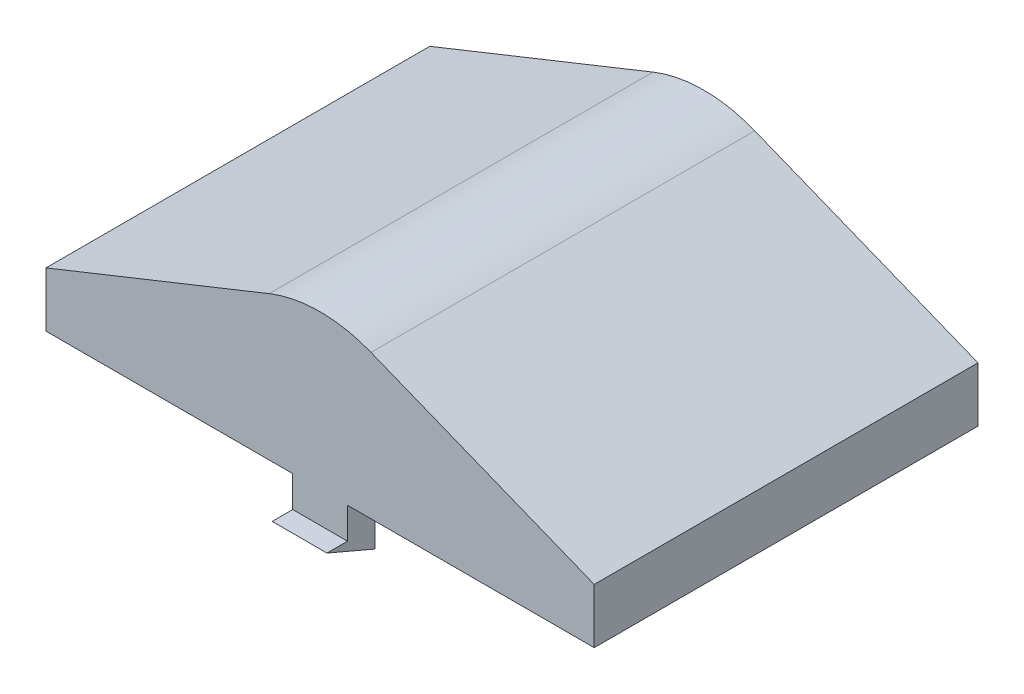
ISO-10303-21;
HEADER;
FILE_DESCRIPTION(('STEP AP214'),'2;1');
FILE_NAME('part.step','',(''),(''),'','','');
FILE_SCHEMA(('AUTOMOTIVE_DESIGN { 1 0 10303 214 1 1 1 1 }'));
ENDSEC;
DATA;
#1=APPLICATION_CONTEXT('core data for automotive mechanical design processes');
#2=APPLICATION_PROTOCOL_DEFINITION('international standard','automotive_design',2000,#1);
#3=PRODUCT_CONTEXT('',#1,'mechanical');
#4=PRODUCT('Part','Part','',(#3));
#5=PRODUCT_RELATED_PRODUCT_CATEGORY('part','',(#4));
#6=PRODUCT_DEFINITION_FORMATION('','',#4);
#7=PRODUCT_DEFINITION_CONTEXT('part definition',#1,'design');
#8=PRODUCT_DEFINITION('design','',#6,#7);
#9=PRODUCT_DEFINITION_SHAPE('','',#8);
#10=(LENGTH_UNIT() NAMED_UNIT(*) SI_UNIT(.MILLI.,.METRE.));
#11=(NAMED_UNIT(*) PLANE_ANGLE_UNIT() SI_UNIT($,.RADIAN.));
#12=(NAMED_UNIT(*) SI_UNIT($,.STERADIAN.) SOLID_ANGLE_UNIT());
#13=UNCERTAINTY_MEASURE_WITH_UNIT(LENGTH_MEASURE(1.E-05),#10,'distance_accuracy_value','');
#14=(GEOMETRIC_REPRESENTATION_CONTEXT(3) GLOBAL_UNCERTAINTY_ASSIGNED_CONTEXT((#13)) GLOBAL_UNIT_ASSIGNED_CONTEXT((#10,
#11,#12)) REPRESENTATION_CONTEXT('',''));
#15=CARTESIAN_POINT('',(0.,0.,0.));
#16=DIRECTION('',(0.,0.,1.));
#17=DIRECTION('',(1.,0.,0.));
#18=AXIS2_PLACEMENT_3D('',#15,#16,#17);
#19=CARTESIAN_POINT('',(-10.,0.,7.));
#20=DIRECTION('',(0.,1.,0.));
#21=DIRECTION('',(-1.,0.,0.));
#22=AXIS2_PLACEMENT_3D('',#19,#20,#21);
#23=PLANE('',#22);
#24=DIRECTION('',(0.,0.,-1.));
#25=VECTOR('',#24,1.);
#26=CARTESIAN_POINT('',(-1.,0.,-6.));
#27=LINE('',#26,#25);
#28=CARTESIAN_POINT('',(-1.,0.,-6.));
#29=VERTEX_POINT('',#28);
#30=CARTESIAN_POINT('',(-1.,0.,-7.));
#31=VERTEX_POINT('',#30);
#32=EDGE_CURVE('E202',#29,#31,#27,.T.);
#33=ORIENTED_EDGE('',*,*,#32,.F.);
#34=DIRECTION('',(1.,0.,0.));
#35=VECTOR('',#34,1.);
#36=CARTESIAN_POINT('',(10.,0.,-6.));
#37=LINE('',#36,#35);
#38=CARTESIAN_POINT('',(-9.,0.,-6.));
#39=VERTEX_POINT('',#38);
#40=EDGE_CURVE('E280',#39,#29,#37,.T.);
#41=ORIENTED_EDGE('',*,*,#40,.F.);
#42=DIRECTION('',(0.,0.,-1.));
#43=VECTOR('',#42,1.);
#44=CARTESIAN_POINT('',(-9.,0.,7.));
#45=LINE('',#44,#43);
#46=CARTESIAN_POINT('',(-9.,0.,6.));
#47=VERTEX_POINT('',#46);
#48=EDGE_CURVE('E303',#47,#39,#45,.T.);
#49=ORIENTED_EDGE('',*,*,#48,.F.);
#50=DIRECTION('',(1.,0.,0.));
#51=VECTOR('',#50,1.);
#52=CARTESIAN_POINT('',(10.,0.,6.));
#53=LINE('',#52,#51);
#54=CARTESIAN_POINT('',(-1.,0.,6.));
#55=VERTEX_POINT('',#54);
#56=EDGE_CURVE('E309',#47,#55,#53,.T.);
#57=ORIENTED_EDGE('',*,*,#56,.T.);
#58=DIRECTION('',(0.,0.,1.));
#59=VECTOR('',#58,1.);
#60=CARTESIAN_POINT('',(-1.,0.,6.));
#61=LINE('',#60,#59);
#62=CARTESIAN_POINT('',(-1.,0.,7.));
#63=VERTEX_POINT('',#62);
#64=EDGE_CURVE('E247',#55,#63,#61,.T.);
#65=ORIENTED_EDGE('',*,*,#64,.T.);
#66=DIRECTION('',(1.,0.,0.));
#67=VECTOR('',#66,1.);
#68=CARTESIAN_POINT('',(-10.,0.,7.));
#69=LINE('',#68,#67);
#70=CARTESIAN_POINT('',(-10.,0.,7.));
#71=VERTEX_POINT('',#70);
#72=EDGE_CURVE('E318',#71,#63,#69,.T.);
#73=ORIENTED_EDGE('',*,*,#72,.F.);
#74=DIRECTION('',(0.,0.,-1.));
#75=VECTOR('',#74,1.);
#76=CARTESIAN_POINT('',(-10.,0.,7.));
#77=LINE('',#76,#75);
#78=CARTESIAN_POINT('',(-10.,0.,-7.));
#79=VERTEX_POINT('',#78);
#80=EDGE_CURVE('E342',#71,#79,#77,.T.);
#81=ORIENTED_EDGE('',*,*,#80,.T.);
#82=DIRECTION('',(1.,0.,0.));
#83=VECTOR('',#82,1.);
#84=CARTESIAN_POINT('',(-10.,0.,-7.));
#85=LINE('',#84,#83);
#86=EDGE_CURVE('E335',#79,#31,#85,.T.);
#87=ORIENTED_EDGE('',*,*,#86,.T.);
#88=EDGE_LOOP('',(#33,#41,#49,#57,#65,#73,#81,#87));
#89=FACE_BOUND('',#88,.T.);
#90=ADVANCED_FACE('F34',(#89),#23,.F.);
#91=CARTESIAN_POINT('',(1.,0.,-6.));
#92=VERTEX_POINT('',#91);
#93=CARTESIAN_POINT('',(9.,0.,-6.));
#94=VERTEX_POINT('',#93);
#95=EDGE_CURVE('E305',#92,#94,#37,.T.);
#96=ORIENTED_EDGE('',*,*,#95,.F.);
#97=DIRECTION('',(0.,0.,-1.));
#98=VECTOR('',#97,1.);
#99=CARTESIAN_POINT('',(1.,0.,-6.));
#100=LINE('',#99,#98);
#101=CARTESIAN_POINT('',(1.,0.,-7.));
#102=VERTEX_POINT('',#101);
#103=EDGE_CURVE('E51',#92,#102,#100,.T.);
#104=ORIENTED_EDGE('',*,*,#103,.T.);
#105=CARTESIAN_POINT('',(10.,0.,-7.));
#106=VERTEX_POINT('',#105);
#107=EDGE_CURVE('E334',#102,#106,#85,.T.);
#108=ORIENTED_EDGE('',*,*,#107,.T.);
#109=DIRECTION('',(0.,0.,-1.));
#110=VECTOR('',#109,1.);
#111=CARTESIAN_POINT('',(10.,0.,7.));
#112=LINE('',#111,#110);
#113=CARTESIAN_POINT('',(10.,0.,7.));
#114=VERTEX_POINT('',#113);
#115=EDGE_CURVE('E339',#114,#106,#112,.T.);
#116=ORIENTED_EDGE('',*,*,#115,.F.);
#117=CARTESIAN_POINT('',(1.,0.,7.));
#118=VERTEX_POINT('',#117);
#119=EDGE_CURVE('E315',#118,#114,#69,.T.);
#120=ORIENTED_EDGE('',*,*,#119,.F.);
#121=DIRECTION('',(0.,0.,1.));
#122=VECTOR('',#121,1.);
#123=CARTESIAN_POINT('',(1.,0.,6.));
#124=LINE('',#123,#122);
#125=CARTESIAN_POINT('',(1.,0.,6.));
#126=VERTEX_POINT('',#125);
#127=EDGE_CURVE('E59',#126,#118,#124,.T.);
#128=ORIENTED_EDGE('',*,*,#127,.F.);
#129=CARTESIAN_POINT('',(9.,0.,6.));
#130=VERTEX_POINT('',#129);
#131=EDGE_CURVE('E236',#126,#130,#53,.T.);
#132=ORIENTED_EDGE('',*,*,#131,.T.);
#133=DIRECTION('',(0.,0.,-1.));
#134=VECTOR('',#133,1.);
#135=CARTESIAN_POINT('',(9.,0.,7.));
#136=LINE('',#135,#134);
#137=EDGE_CURVE('E307',#130,#94,#136,.T.);
#138=ORIENTED_EDGE('',*,*,#137,.T.);
#139=EDGE_LOOP('',(#96,#104,#108,#116,#120,#128,#132,#138));
#140=FACE_BOUND('',#139,.T.);
#141=ADVANCED_FACE('F411',(#140),#23,.F.);
#142=CARTESIAN_POINT('',(10.,0.,7.));
#143=DIRECTION('',(-1.,0.,0.));
#144=DIRECTION('',(0.,-1.,0.));
#145=AXIS2_PLACEMENT_3D('',#142,#143,#144);
#146=PLANE('',#145);
#147=DIRECTION('',(0.,1.,0.));
#148=VECTOR('',#147,1.);
#149=CARTESIAN_POINT('',(10.,0.,-7.));
#150=LINE('',#149,#148);
#151=CARTESIAN_POINT('',(10.,2.,-7.));
#152=VERTEX_POINT('',#151);
#153=EDGE_CURVE('E292',#106,#152,#150,.T.);
#154=ORIENTED_EDGE('',*,*,#153,.T.);
#155=DIRECTION('',(0.,0.,-1.));
#156=VECTOR('',#155,1.);
#157=CARTESIAN_POINT('',(10.,2.,7.));
#158=LINE('',#157,#156);
#159=CARTESIAN_POINT('',(10.,2.,7.));
#160=VERTEX_POINT('',#159);
#161=EDGE_CURVE('E348',#160,#152,#158,.T.);
#162=ORIENTED_EDGE('',*,*,#161,.F.);
#163=DIRECTION('',(0.,1.,0.));
#164=VECTOR('',#163,1.);
#165=CARTESIAN_POINT('',(10.,0.,7.));
#166=LINE('',#165,#164);
#167=EDGE_CURVE('E338',#114,#160,#166,.T.);
#168=ORIENTED_EDGE('',*,*,#167,.F.);
#169=ORIENTED_EDGE('',*,*,#115,.T.);
#170=EDGE_LOOP('',(#154,#162,#168,#169));
#171=FACE_BOUND('',#170,.T.);
#172=ADVANCED_FACE('F415',(#171),#146,.F.);
#173=CARTESIAN_POINT('',(10.,2.,7.));
#174=DIRECTION('',(-0.371390676354104,-0.928476690885259,0.));
#175=DIRECTION('',(0.928476690885259,-0.371390676354104,0.));
#176=AXIS2_PLACEMENT_3D('',#173,#174,#175);
#177=PLANE('',#176);
#178=DIRECTION('',(-0.928476690885259,0.371390676354104,0.));
#179=VECTOR('',#178,1.);
#180=CARTESIAN_POINT('',(10.,2.,-7.));
#181=LINE('',#180,#179);
#182=CARTESIAN_POINT('',(1.85695338177052,5.25721864729179,-7.));
#183=VERTEX_POINT('',#182);
#184=EDGE_CURVE('E327',#152,#183,#181,.T.);
#185=ORIENTED_EDGE('',*,*,#184,.T.);
#186=DIRECTION('',(0.,0.,-1.));
#187=VECTOR('',#186,1.);
#188=CARTESIAN_POINT('',(1.85695338177052,5.25721864729179,7.));
#189=LINE('',#188,#187);
#190=CARTESIAN_POINT('',(1.85695338177052,5.25721864729179,7.));
#191=VERTEX_POINT('',#190);
#192=EDGE_CURVE('E43',#183,#191,#189,.F.);
#193=ORIENTED_EDGE('',*,*,#192,.T.);
#194=DIRECTION('',(-0.928476690885259,0.371390676354104,0.));
#195=VECTOR('',#194,1.);
#196=CARTESIAN_POINT('',(10.,2.,7.));
#197=LINE('',#196,#195);
#198=EDGE_CURVE('E360',#160,#191,#197,.T.);
#199=ORIENTED_EDGE('',*,*,#198,.F.);
#200=ORIENTED_EDGE('',*,*,#161,.T.);
#201=EDGE_LOOP('',(#185,#193,#199,#200));
#202=FACE_BOUND('',#201,.T.);
#203=ADVANCED_FACE('F359',(#202),#177,.F.);
#204=CARTESIAN_POINT('',(-10.,2.00000000000001,7.));
#205=DIRECTION('',(0.371390676354103,-0.92847669088526,0.));
#206=DIRECTION('',(0.92847669088526,0.371390676354103,0.));
#207=AXIS2_PLACEMENT_3D('',#204,#205,#206);
#208=PLANE('',#207);
#209=DIRECTION('',(-0.92847669088526,-0.371390676354103,0.));
#210=VECTOR('',#209,1.);
#211=CARTESIAN_POINT('',(-10.,2.00000000000001,7.));
#212=LINE('',#211,#210);
#213=CARTESIAN_POINT('',(-1.85695338177051,5.25721864729179,7.));
#214=VERTEX_POINT('',#213);
#215=CARTESIAN_POINT('',(-10.,2.00000000000001,7.));
#216=VERTEX_POINT('',#215);
#217=EDGE_CURVE('E369',#214,#216,#212,.T.);
#218=ORIENTED_EDGE('',*,*,#217,.F.);
#219=DIRECTION('',(0.,0.,-1.));
#220=VECTOR('',#219,1.);
#221=CARTESIAN_POINT('',(-1.85695338177051,5.25721864729179,7.));
#222=LINE('',#221,#220);
#223=CARTESIAN_POINT('',(-1.85695338177051,5.25721864729179,-7.));
#224=VERTEX_POINT('',#223);
#225=EDGE_CURVE('E351',#214,#224,#222,.T.);
#226=ORIENTED_EDGE('',*,*,#225,.T.);
#227=DIRECTION('',(-0.92847669088526,-0.371390676354103,0.));
#228=VECTOR('',#227,1.);
#229=CARTESIAN_POINT('',(-10.,2.00000000000001,-7.));
#230=LINE('',#229,#228);
#231=CARTESIAN_POINT('',(-10.,2.00000000000001,-7.));
#232=VERTEX_POINT('',#231);
#233=EDGE_CURVE('E330',#224,#232,#230,.T.);
#234=ORIENTED_EDGE('',*,*,#233,.T.);
#235=DIRECTION('',(0.,0.,-1.));
#236=VECTOR('',#235,1.);
#237=CARTESIAN_POINT('',(-10.,2.00000000000001,7.));
#238=LINE('',#237,#236);
#239=EDGE_CURVE('E345',#216,#232,#238,.T.);
#240=ORIENTED_EDGE('',*,*,#239,.F.);
#241=EDGE_LOOP('',(#218,#226,#234,#240));
#242=FACE_BOUND('',#241,.T.);
#243=ADVANCED_FACE('F374',(#242),#208,.F.);
#244=CARTESIAN_POINT('',(-10.,0.,7.));
#245=DIRECTION('',(1.,0.,0.));
#246=DIRECTION('',(0.,1.,0.));
#247=AXIS2_PLACEMENT_3D('',#244,#245,#246);
#248=PLANE('',#247);
#249=DIRECTION('',(0.,-1.,0.));
#250=VECTOR('',#249,1.);
#251=CARTESIAN_POINT('',(-10.,0.,-7.));
#252=LINE('',#251,#250);
#253=EDGE_CURVE('E332',#232,#79,#252,.T.);
#254=ORIENTED_EDGE('',*,*,#253,.T.);
#255=ORIENTED_EDGE('',*,*,#80,.F.);
#256=DIRECTION('',(0.,-1.,0.));
#257=VECTOR('',#256,1.);
#258=CARTESIAN_POINT('',(-10.,0.,7.));
#259=LINE('',#258,#257);
#260=EDGE_CURVE('E319',#216,#71,#259,.T.);
#261=ORIENTED_EDGE('',*,*,#260,.F.);
#262=ORIENTED_EDGE('',*,*,#239,.T.);
#263=EDGE_LOOP('',(#254,#255,#261,#262));
#264=FACE_BOUND('',#263,.T.);
#265=ADVANCED_FACE('F382',(#264),#248,.F.);
#266=CARTESIAN_POINT('',(10.,0.,7.));
#267=DIRECTION('',(0.,0.,-1.));
#268=DIRECTION('',(-1.,0.,0.));
#269=AXIS2_PLACEMENT_3D('',#266,#267,#268);
#270=PLANE('',#269);
#271=ORIENTED_EDGE('',*,*,#198,.T.);
#272=CARTESIAN_POINT('',(0.,0.614835192865495,7.));
#273=DIRECTION('',(0.,0.,-1.));
#274=DIRECTION('',(-1.,0.,0.));
#275=AXIS2_PLACEMENT_3D('',#272,#273,#274);
#276=CIRCLE('',#275,5.);
#277=EDGE_CURVE('E11',#191,#214,#276,.F.);
#278=ORIENTED_EDGE('',*,*,#277,.T.);
#279=ORIENTED_EDGE('',*,*,#217,.T.);
#280=ORIENTED_EDGE('',*,*,#260,.T.);
#281=ORIENTED_EDGE('',*,*,#72,.T.);
#282=DIRECTION('',(0.,-1.,0.));
#283=VECTOR('',#282,1.);
#284=CARTESIAN_POINT('',(-1.,0.,7.));
#285=LINE('',#284,#283);
#286=CARTESIAN_POINT('',(-1.,-1.1351648071345,7.));
#287=VERTEX_POINT('',#286);
#288=EDGE_CURVE('E250',#63,#287,#285,.T.);
#289=ORIENTED_EDGE('',*,*,#288,.T.);
#290=DIRECTION('',(-1.,0.,0.));
#291=VECTOR('',#290,1.);
#292=CARTESIAN_POINT('',(1.,-1.1351648071345,7.));
#293=LINE('',#292,#291);
#294=CARTESIAN_POINT('',(1.,-1.1351648071345,7.));
#295=VERTEX_POINT('',#294);
#296=EDGE_CURVE('E264',#295,#287,#293,.T.);
#297=ORIENTED_EDGE('',*,*,#296,.F.);
#298=DIRECTION('',(0.,-1.,0.));
#299=VECTOR('',#298,1.);
#300=CARTESIAN_POINT('',(1.,0.,7.));
#301=LINE('',#300,#299);
#302=EDGE_CURVE('E234',#118,#295,#301,.T.);
#303=ORIENTED_EDGE('',*,*,#302,.F.);
#304=ORIENTED_EDGE('',*,*,#119,.T.);
#305=ORIENTED_EDGE('',*,*,#167,.T.);
#306=EDGE_LOOP('',(#271,#278,#279,#280,#281,#289,#297,#303,#304,#305));
#307=FACE_BOUND('',#306,.T.);
#308=ADVANCED_FACE('F365',(#307),#270,.F.);
#309=CARTESIAN_POINT('',(10.,0.,-7.));
#310=DIRECTION('',(0.,0.,-1.));
#311=DIRECTION('',(-1.,0.,0.));
#312=AXIS2_PLACEMENT_3D('',#309,#310,#311);
#313=PLANE('',#312);
#314=ORIENTED_EDGE('',*,*,#233,.F.);
#315=CARTESIAN_POINT('',(0.,0.614835192865495,-7.));
#316=DIRECTION('',(0.,0.,-1.));
#317=DIRECTION('',(-1.,0.,0.));
#318=AXIS2_PLACEMENT_3D('',#315,#316,#317);
#319=CIRCLE('',#318,5.);
#320=EDGE_CURVE('E354',#224,#183,#319,.T.);
#321=ORIENTED_EDGE('',*,*,#320,.T.);
#322=ORIENTED_EDGE('',*,*,#184,.F.);
#323=ORIENTED_EDGE('',*,*,#153,.F.);
#324=ORIENTED_EDGE('',*,*,#107,.F.);
#325=DIRECTION('',(0.,-1.,0.));
#326=VECTOR('',#325,1.);
#327=CARTESIAN_POINT('',(1.,0.,-7.));
#328=LINE('',#327,#326);
#329=CARTESIAN_POINT('',(1.,-1.1351648071345,-7.));
#330=VERTEX_POINT('',#329);
#331=EDGE_CURVE('E207',#102,#330,#328,.T.);
#332=ORIENTED_EDGE('',*,*,#331,.T.);
#333=DIRECTION('',(-1.,0.,0.));
#334=VECTOR('',#333,1.);
#335=CARTESIAN_POINT('',(1.,-1.1351648071345,-7.));
#336=LINE('',#335,#334);
#337=CARTESIAN_POINT('',(-1.,-1.1351648071345,-7.));
#338=VERTEX_POINT('',#337);
#339=EDGE_CURVE('E213',#330,#338,#336,.T.);
#340=ORIENTED_EDGE('',*,*,#339,.T.);
#341=DIRECTION('',(0.,-1.,0.));
#342=VECTOR('',#341,1.);
#343=CARTESIAN_POINT('',(-1.,0.,-7.));
#344=LINE('',#343,#342);
#345=EDGE_CURVE('E220',#31,#338,#344,.T.);
#346=ORIENTED_EDGE('',*,*,#345,.F.);
#347=ORIENTED_EDGE('',*,*,#86,.F.);
#348=ORIENTED_EDGE('',*,*,#253,.F.);
#349=EDGE_LOOP('',(#314,#321,#322,#323,#324,#332,#340,#346,#347,#348));
#350=FACE_BOUND('',#349,.T.);
#351=ADVANCED_FACE('F378',(#350),#313,.T.);
#352=CARTESIAN_POINT('',(0.,0.614835192865495,7.));
#353=DIRECTION('',(0.,0.,-1.));
#354=DIRECTION('',(-1.,0.,0.));
#355=AXIS2_PLACEMENT_3D('',#352,#353,#354);
#356=CYLINDRICAL_SURFACE('',#355,5.);
#357=ORIENTED_EDGE('',*,*,#277,.F.);
#358=ORIENTED_EDGE('',*,*,#192,.F.);
#359=ORIENTED_EDGE('',*,*,#320,.F.);
#360=ORIENTED_EDGE('',*,*,#225,.F.);
#361=EDGE_LOOP('',(#357,#358,#359,#360));
#362=FACE_BOUND('',#361,.T.);
#363=ADVANCED_FACE('F36',(#362),#356,.T.);
#364=CARTESIAN_POINT('',(9.,0.,7.));
#365=DIRECTION('',(-1.,0.,0.));
#366=DIRECTION('',(0.,-1.,0.));
#367=AXIS2_PLACEMENT_3D('',#364,#365,#366);
#368=PLANE('',#367);
#369=DIRECTION('',(0.,1.,0.));
#370=VECTOR('',#369,1.);
#371=CARTESIAN_POINT('',(9.,0.,-6.));
#372=LINE('',#371,#370);
#373=CARTESIAN_POINT('',(9.,1.3229670385731,-6.));
#374=VERTEX_POINT('',#373);
#375=EDGE_CURVE('E267',#94,#374,#372,.T.);
#376=ORIENTED_EDGE('',*,*,#375,.F.);
#377=ORIENTED_EDGE('',*,*,#137,.F.);
#378=DIRECTION('',(0.,1.,0.));
#379=VECTOR('',#378,1.);
#380=CARTESIAN_POINT('',(9.,0.,6.));
#381=LINE('',#380,#379);
#382=CARTESIAN_POINT('',(9.,1.3229670385731,6.));
#383=VERTEX_POINT('',#382);
#384=EDGE_CURVE('E276',#130,#383,#381,.T.);
#385=ORIENTED_EDGE('',*,*,#384,.T.);
#386=DIRECTION('',(0.,0.,-1.));
#387=VECTOR('',#386,1.);
#388=CARTESIAN_POINT('',(9.,1.3229670385731,7.));
#389=LINE('',#388,#387);
#390=EDGE_CURVE('E271',#383,#374,#389,.T.);
#391=ORIENTED_EDGE('',*,*,#390,.T.);
#392=EDGE_LOOP('',(#376,#377,#385,#391));
#393=FACE_BOUND('',#392,.T.);
#394=ADVANCED_FACE('F421',(#393),#368,.T.);
#395=CARTESIAN_POINT('',(9.6286093236459,1.07152330911474,7.));
#396=DIRECTION('',(-0.371390676354104,-0.928476690885259,0.));
#397=DIRECTION('',(0.928476690885259,-0.371390676354104,0.));
#398=AXIS2_PLACEMENT_3D('',#395,#396,#397);
#399=PLANE('',#398);
#400=DIRECTION('',(-0.928476690885259,0.371390676354104,0.));
#401=VECTOR('',#400,1.);
#402=CARTESIAN_POINT('',(10.3182644960597,0.795661240149223,-6.));
#403=LINE('',#402,#401);
#404=CARTESIAN_POINT('',(1.48556270541641,4.32874195640653,-6.));
#405=VERTEX_POINT('',#404);
#406=EDGE_CURVE('E270',#374,#405,#403,.T.);
#407=ORIENTED_EDGE('',*,*,#406,.F.);
#408=ORIENTED_EDGE('',*,*,#390,.F.);
#409=DIRECTION('',(-0.928476690885259,0.371390676354104,0.));
#410=VECTOR('',#409,1.);
#411=CARTESIAN_POINT('',(10.3182644960597,0.795661240149223,6.));
#412=LINE('',#411,#410);
#413=CARTESIAN_POINT('',(1.48556270541641,4.32874195640653,6.));
#414=VERTEX_POINT('',#413);
#415=EDGE_CURVE('E279',#383,#414,#412,.T.);
#416=ORIENTED_EDGE('',*,*,#415,.T.);
#417=DIRECTION('',(0.,0.,1.));
#418=VECTOR('',#417,1.);
#419=CARTESIAN_POINT('',(1.48556270541641,4.32874195640653,7.));
#420=LINE('',#419,#418);
#421=EDGE_CURVE('E284',#405,#414,#420,.T.);
#422=ORIENTED_EDGE('',*,*,#421,.F.);
#423=EDGE_LOOP('',(#407,#408,#416,#422));
#424=FACE_BOUND('',#423,.T.);
#425=ADVANCED_FACE('F428',(#424),#399,.T.);
#426=CARTESIAN_POINT('',(-9.6286093236459,1.07152330911475,7.));
#427=DIRECTION('',(0.371390676354103,-0.92847669088526,0.));
#428=DIRECTION('',(0.92847669088526,0.371390676354103,0.));
#429=AXIS2_PLACEMENT_3D('',#426,#427,#428);
#430=PLANE('',#429);
#431=DIRECTION('',(-0.92847669088526,-0.371390676354103,0.));
#432=VECTOR('',#431,1.);
#433=CARTESIAN_POINT('',(6.92311481428515,7.69221296428715,6.));
#434=LINE('',#433,#432);
#435=CARTESIAN_POINT('',(-1.48556270541641,4.32874195640653,6.));
#436=VERTEX_POINT('',#435);
#437=CARTESIAN_POINT('',(-9.,1.32296703857311,6.));
#438=VERTEX_POINT('',#437);
#439=EDGE_CURVE('E290',#436,#438,#434,.T.);
#440=ORIENTED_EDGE('',*,*,#439,.T.);
#441=DIRECTION('',(0.,0.,-1.));
#442=VECTOR('',#441,1.);
#443=CARTESIAN_POINT('',(-9.,1.32296703857311,7.));
#444=LINE('',#443,#442);
#445=CARTESIAN_POINT('',(-9.,1.32296703857311,-6.));
#446=VERTEX_POINT('',#445);
#447=EDGE_CURVE('E275',#438,#446,#444,.T.);
#448=ORIENTED_EDGE('',*,*,#447,.T.);
#449=DIRECTION('',(-0.92847669088526,-0.371390676354103,0.));
#450=VECTOR('',#449,1.);
#451=CARTESIAN_POINT('',(6.92311481428515,7.69221296428715,-6.));
#452=LINE('',#451,#450);
#453=CARTESIAN_POINT('',(-1.48556270541641,4.32874195640653,-6.));
#454=VERTEX_POINT('',#453);
#455=EDGE_CURVE('E283',#454,#446,#452,.T.);
#456=ORIENTED_EDGE('',*,*,#455,.F.);
#457=DIRECTION('',(0.,0.,1.));
#458=VECTOR('',#457,1.);
#459=CARTESIAN_POINT('',(-1.48556270541641,4.32874195640653,7.));
#460=LINE('',#459,#458);
#461=EDGE_CURVE('E274',#436,#454,#460,.F.);
#462=ORIENTED_EDGE('',*,*,#461,.F.);
#463=EDGE_LOOP('',(#440,#448,#456,#462));
#464=FACE_BOUND('',#463,.T.);
#465=ADVANCED_FACE('F436',(#464),#430,.T.);
#466=CARTESIAN_POINT('',(-9.,0.,7.));
#467=DIRECTION('',(1.,0.,0.));
#468=DIRECTION('',(0.,1.,0.));
#469=AXIS2_PLACEMENT_3D('',#466,#467,#468);
#470=PLANE('',#469);
#471=DIRECTION('',(0.,-1.,0.));
#472=VECTOR('',#471,1.);
#473=CARTESIAN_POINT('',(-9.,0.,-6.));
#474=LINE('',#473,#472);
#475=EDGE_CURVE('E300',#446,#39,#474,.T.);
#476=ORIENTED_EDGE('',*,*,#475,.F.);
#477=ORIENTED_EDGE('',*,*,#447,.F.);
#478=DIRECTION('',(0.,-1.,0.));
#479=VECTOR('',#478,1.);
#480=CARTESIAN_POINT('',(-9.,0.,6.));
#481=LINE('',#480,#479);
#482=EDGE_CURVE('E294',#438,#47,#481,.T.);
#483=ORIENTED_EDGE('',*,*,#482,.T.);
#484=ORIENTED_EDGE('',*,*,#48,.T.);
#485=EDGE_LOOP('',(#476,#477,#483,#484));
#486=FACE_BOUND('',#485,.T.);
#487=ADVANCED_FACE('F442',(#486),#470,.T.);
#488=CARTESIAN_POINT('',(10.,0.,6.));
#489=DIRECTION('',(0.,0.,-1.));
#490=DIRECTION('',(-1.,0.,0.));
#491=AXIS2_PLACEMENT_3D('',#488,#489,#490);
#492=PLANE('',#491);
#493=ORIENTED_EDGE('',*,*,#415,.F.);
#494=ORIENTED_EDGE('',*,*,#384,.F.);
#495=ORIENTED_EDGE('',*,*,#131,.F.);
#496=DIRECTION('',(0.,1.,0.));
#497=VECTOR('',#496,1.);
#498=CARTESIAN_POINT('',(1.,0.,6.));
#499=LINE('',#498,#497);
#500=CARTESIAN_POINT('',(1.,-1.8851648071345,6.));
#501=VERTEX_POINT('',#500);
#502=EDGE_CURVE('E235',#501,#126,#499,.T.);
#503=ORIENTED_EDGE('',*,*,#502,.F.);
#504=DIRECTION('',(-1.,0.,0.));
#505=VECTOR('',#504,1.);
#506=CARTESIAN_POINT('',(1.,-1.8851648071345,6.));
#507=LINE('',#506,#505);
#508=CARTESIAN_POINT('',(-1.,-1.8851648071345,6.));
#509=VERTEX_POINT('',#508);
#510=EDGE_CURVE('E258',#501,#509,#507,.T.);
#511=ORIENTED_EDGE('',*,*,#510,.T.);
#512=DIRECTION('',(0.,1.,0.));
#513=VECTOR('',#512,1.);
#514=CARTESIAN_POINT('',(-1.,0.,6.));
#515=LINE('',#514,#513);
#516=EDGE_CURVE('E194',#509,#55,#515,.T.);
#517=ORIENTED_EDGE('',*,*,#516,.T.);
#518=ORIENTED_EDGE('',*,*,#56,.F.);
#519=ORIENTED_EDGE('',*,*,#482,.F.);
#520=ORIENTED_EDGE('',*,*,#439,.F.);
#521=CARTESIAN_POINT('',(0.,0.614835192865495,6.));
#522=DIRECTION('',(0.,0.,-1.));
#523=DIRECTION('',(-1.,0.,0.));
#524=AXIS2_PLACEMENT_3D('',#521,#522,#523);
#525=CIRCLE('',#524,4.);
#526=EDGE_CURVE('E286',#414,#436,#525,.F.);
#527=ORIENTED_EDGE('',*,*,#526,.F.);
#528=EDGE_LOOP('',(#493,#494,#495,#503,#511,#517,#518,#519,#520,#527));
#529=FACE_BOUND('',#528,.T.);
#530=ADVANCED_FACE('F425',(#529),#492,.T.);
#531=CARTESIAN_POINT('',(10.,0.,-6.));
#532=DIRECTION('',(0.,0.,-1.));
#533=DIRECTION('',(-1.,0.,0.));
#534=AXIS2_PLACEMENT_3D('',#531,#532,#533);
#535=PLANE('',#534);
#536=ORIENTED_EDGE('',*,*,#455,.T.);
#537=ORIENTED_EDGE('',*,*,#475,.T.);
#538=ORIENTED_EDGE('',*,*,#40,.T.);
#539=DIRECTION('',(0.,1.,0.));
#540=VECTOR('',#539,1.);
#541=CARTESIAN_POINT('',(-1.,0.,-6.));
#542=LINE('',#541,#540);
#543=CARTESIAN_POINT('',(-1.,-1.8851648071345,-6.));
#544=VERTEX_POINT('',#543);
#545=EDGE_CURVE('E189',#544,#29,#542,.T.);
#546=ORIENTED_EDGE('',*,*,#545,.F.);
#547=DIRECTION('',(-1.,0.,0.));
#548=VECTOR('',#547,1.);
#549=CARTESIAN_POINT('',(1.,-1.8851648071345,-6.));
#550=LINE('',#549,#548);
#551=CARTESIAN_POINT('',(1.,-1.8851648071345,-6.));
#552=VERTEX_POINT('',#551);
#553=EDGE_CURVE('E184',#552,#544,#550,.T.);
#554=ORIENTED_EDGE('',*,*,#553,.F.);
#555=DIRECTION('',(0.,1.,0.));
#556=VECTOR('',#555,1.);
#557=CARTESIAN_POINT('',(1.,0.,-6.));
#558=LINE('',#557,#556);
#559=EDGE_CURVE('E186',#552,#92,#558,.T.);
#560=ORIENTED_EDGE('',*,*,#559,.T.);
#561=ORIENTED_EDGE('',*,*,#95,.T.);
#562=ORIENTED_EDGE('',*,*,#375,.T.);
#563=ORIENTED_EDGE('',*,*,#406,.T.);
#564=CARTESIAN_POINT('',(0.,0.614835192865495,-6.));
#565=DIRECTION('',(0.,0.,-1.));
#566=DIRECTION('',(-1.,0.,0.));
#567=AXIS2_PLACEMENT_3D('',#564,#565,#566);
#568=CIRCLE('',#567,4.);
#569=EDGE_CURVE('E287',#454,#405,#568,.T.);
#570=ORIENTED_EDGE('',*,*,#569,.F.);
#571=EDGE_LOOP('',(#536,#537,#538,#546,#554,#560,#561,#562,#563,#570));
#572=FACE_BOUND('',#571,.T.);
#573=ADVANCED_FACE('F185',(#572),#535,.F.);
#574=CARTESIAN_POINT('',(0.,0.614835192865495,7.));
#575=DIRECTION('',(0.,0.,-1.));
#576=DIRECTION('',(-1.,0.,0.));
#577=AXIS2_PLACEMENT_3D('',#574,#575,#576);
#578=CYLINDRICAL_SURFACE('',#577,4.);
#579=ORIENTED_EDGE('',*,*,#526,.T.);
#580=ORIENTED_EDGE('',*,*,#461,.T.);
#581=ORIENTED_EDGE('',*,*,#569,.T.);
#582=ORIENTED_EDGE('',*,*,#421,.T.);
#583=EDGE_LOOP('',(#579,#580,#581,#582));
#584=FACE_BOUND('',#583,.T.);
#585=ADVANCED_FACE('F433',(#584),#578,.F.);
#586=CARTESIAN_POINT('',(1.,-1.1351648071345,7.75));
#587=DIRECTION('',(0.,-1.,0.));
#588=DIRECTION('',(0.,0.,-1.));
#589=AXIS2_PLACEMENT_3D('',#586,#587,#588);
#590=PLANE('',#589);
#591=DIRECTION('',(0.,0.,1.));
#592=VECTOR('',#591,1.);
#593=CARTESIAN_POINT('',(-1.,-1.1351648071345,7.75));
#594=LINE('',#593,#592);
#595=CARTESIAN_POINT('',(-1.,-1.1351648071345,7.75));
#596=VERTEX_POINT('',#595);
#597=EDGE_CURVE('E255',#287,#596,#594,.T.);
#598=ORIENTED_EDGE('',*,*,#597,.T.);
#599=DIRECTION('',(-1.,0.,0.));
#600=VECTOR('',#599,1.);
#601=CARTESIAN_POINT('',(1.,-1.1351648071345,7.75));
#602=LINE('',#601,#600);
#603=CARTESIAN_POINT('',(1.,-1.1351648071345,7.75));
#604=VERTEX_POINT('',#603);
#605=EDGE_CURVE('E261',#604,#596,#602,.T.);
#606=ORIENTED_EDGE('',*,*,#605,.F.);
#607=DIRECTION('',(0.,0.,1.));
#608=VECTOR('',#607,1.);
#609=CARTESIAN_POINT('',(1.,-1.1351648071345,7.75));
#610=LINE('',#609,#608);
#611=EDGE_CURVE('E229',#295,#604,#610,.T.);
#612=ORIENTED_EDGE('',*,*,#611,.F.);
#613=ORIENTED_EDGE('',*,*,#296,.T.);
#614=EDGE_LOOP('',(#598,#606,#612,#613));
#615=FACE_BOUND('',#614,.T.);
#616=ADVANCED_FACE('F400',(#615),#590,.F.);
#617=CARTESIAN_POINT('',(1.,-1.8851648071345,6.));
#618=DIRECTION('',(0.,0.919145030018058,-0.393919298579168));
#619=DIRECTION('',(0.,0.393919298579168,0.919145030018058));
#620=AXIS2_PLACEMENT_3D('',#617,#618,#619);
#621=PLANE('',#620);
#622=DIRECTION('',(0.,-0.393919298579168,-0.919145030018058));
#623=VECTOR('',#622,1.);
#624=CARTESIAN_POINT('',(-1.,-1.8851648071345,6.));
#625=LINE('',#624,#623);
#626=EDGE_CURVE('E244',#596,#509,#625,.T.);
#627=ORIENTED_EDGE('',*,*,#626,.T.);
#628=ORIENTED_EDGE('',*,*,#510,.F.);
#629=DIRECTION('',(0.,-0.393919298579168,-0.919145030018058));
#630=VECTOR('',#629,1.);
#631=CARTESIAN_POINT('',(1.,-1.8851648071345,6.));
#632=LINE('',#631,#630);
#633=EDGE_CURVE('E254',#604,#501,#632,.T.);
#634=ORIENTED_EDGE('',*,*,#633,.F.);
#635=ORIENTED_EDGE('',*,*,#605,.T.);
#636=EDGE_LOOP('',(#627,#628,#634,#635));
#637=FACE_BOUND('',#636,.T.);
#638=ADVANCED_FACE('F404',(#637),#621,.F.);
#639=CARTESIAN_POINT('',(1.,-1.1351648071345,6.));
#640=DIRECTION('',(1.,0.,0.));
#641=DIRECTION('',(0.,0.,-1.));
#642=AXIS2_PLACEMENT_3D('',#639,#640,#641);
#643=PLANE('',#642);
#644=ORIENTED_EDGE('',*,*,#502,.T.);
#645=ORIENTED_EDGE('',*,*,#127,.T.);
#646=ORIENTED_EDGE('',*,*,#302,.T.);
#647=ORIENTED_EDGE('',*,*,#611,.T.);
#648=ORIENTED_EDGE('',*,*,#633,.T.);
#649=EDGE_LOOP('',(#644,#645,#646,#647,#648));
#650=FACE_BOUND('',#649,.T.);
#651=ADVANCED_FACE('F408',(#650),#643,.T.);
#652=CARTESIAN_POINT('',(-1.,-1.1351648071345,6.));
#653=DIRECTION('',(1.,0.,0.));
#654=DIRECTION('',(0.,0.,-1.));
#655=AXIS2_PLACEMENT_3D('',#652,#653,#654);
#656=PLANE('',#655);
#657=ORIENTED_EDGE('',*,*,#516,.F.);
#658=ORIENTED_EDGE('',*,*,#626,.F.);
#659=ORIENTED_EDGE('',*,*,#597,.F.);
#660=ORIENTED_EDGE('',*,*,#288,.F.);
#661=ORIENTED_EDGE('',*,*,#64,.F.);
#662=EDGE_LOOP('',(#657,#658,#659,#660,#661));
#663=FACE_BOUND('',#662,.T.);
#664=ADVANCED_FACE('F394',(#663),#656,.F.);
#665=CARTESIAN_POINT('',(1.,-1.8851648071345,-6.));
#666=DIRECTION('',(0.,-0.919145030018058,-0.393919298579168));
#667=DIRECTION('',(0.,0.393919298579168,-0.919145030018058));
#668=AXIS2_PLACEMENT_3D('',#665,#666,#667);
#669=PLANE('',#668);
#670=DIRECTION('',(0.,-0.393919298579168,0.919145030018058));
#671=VECTOR('',#670,1.);
#672=CARTESIAN_POINT('',(-1.,-1.8851648071345,-6.));
#673=LINE('',#672,#671);
#674=CARTESIAN_POINT('',(-1.,-1.1351648071345,-7.75));
#675=VERTEX_POINT('',#674);
#676=EDGE_CURVE('E215',#675,#544,#673,.T.);
#677=ORIENTED_EDGE('',*,*,#676,.F.);
#678=DIRECTION('',(-1.,0.,0.));
#679=VECTOR('',#678,1.);
#680=CARTESIAN_POINT('',(1.,-1.1351648071345,-7.75));
#681=LINE('',#680,#679);
#682=CARTESIAN_POINT('',(1.,-1.1351648071345,-7.75));
#683=VERTEX_POINT('',#682);
#684=EDGE_CURVE('E195',#683,#675,#681,.T.);
#685=ORIENTED_EDGE('',*,*,#684,.F.);
#686=DIRECTION('',(0.,-0.393919298579168,0.919145030018058));
#687=VECTOR('',#686,1.);
#688=CARTESIAN_POINT('',(1.,-1.8851648071345,-6.));
#689=LINE('',#688,#687);
#690=EDGE_CURVE('E200',#683,#552,#689,.T.);
#691=ORIENTED_EDGE('',*,*,#690,.T.);
#692=ORIENTED_EDGE('',*,*,#553,.T.);
#693=EDGE_LOOP('',(#677,#685,#691,#692));
#694=FACE_BOUND('',#693,.T.);
#695=ADVANCED_FACE('F204',(#694),#669,.T.);
#696=CARTESIAN_POINT('',(1.,-1.1351648071345,-7.75));
#697=DIRECTION('',(0.,1.,0.));
#698=DIRECTION('',(0.,0.,1.));
#699=AXIS2_PLACEMENT_3D('',#696,#697,#698);
#700=PLANE('',#699);
#701=DIRECTION('',(0.,0.,-1.));
#702=VECTOR('',#701,1.);
#703=CARTESIAN_POINT('',(-1.,-1.1351648071345,-7.75));
#704=LINE('',#703,#702);
#705=EDGE_CURVE('E217',#338,#675,#704,.T.);
#706=ORIENTED_EDGE('',*,*,#705,.F.);
#707=ORIENTED_EDGE('',*,*,#339,.F.);
#708=DIRECTION('',(0.,0.,-1.));
#709=VECTOR('',#708,1.);
#710=CARTESIAN_POINT('',(1.,-1.1351648071345,-7.75));
#711=LINE('',#710,#709);
#712=EDGE_CURVE('E205',#330,#683,#711,.T.);
#713=ORIENTED_EDGE('',*,*,#712,.T.);
#714=ORIENTED_EDGE('',*,*,#684,.T.);
#715=EDGE_LOOP('',(#706,#707,#713,#714));
#716=FACE_BOUND('',#715,.T.);
#717=ADVANCED_FACE('F448',(#716),#700,.T.);
#718=CARTESIAN_POINT('',(1.,-1.1351648071345,-6.));
#719=DIRECTION('',(1.,0.,0.));
#720=DIRECTION('',(0.,0.,1.));
#721=AXIS2_PLACEMENT_3D('',#718,#719,#720);
#722=PLANE('',#721);
#723=ORIENTED_EDGE('',*,*,#559,.F.);
#724=ORIENTED_EDGE('',*,*,#690,.F.);
#725=ORIENTED_EDGE('',*,*,#712,.F.);
#726=ORIENTED_EDGE('',*,*,#331,.F.);
#727=ORIENTED_EDGE('',*,*,#103,.F.);
#728=EDGE_LOOP('',(#723,#724,#725,#726,#727));
#729=FACE_BOUND('',#728,.T.);
#730=ADVANCED_FACE('F198',(#729),#722,.T.);
#731=CARTESIAN_POINT('',(-1.,-1.1351648071345,-6.));
#732=DIRECTION('',(1.,0.,0.));
#733=DIRECTION('',(0.,0.,1.));
#734=AXIS2_PLACEMENT_3D('',#731,#732,#733);
#735=PLANE('',#734);
#736=ORIENTED_EDGE('',*,*,#545,.T.);
#737=ORIENTED_EDGE('',*,*,#32,.T.);
#738=ORIENTED_EDGE('',*,*,#345,.T.);
#739=ORIENTED_EDGE('',*,*,#705,.T.);
#740=ORIENTED_EDGE('',*,*,#676,.T.);
#741=EDGE_LOOP('',(#736,#737,#738,#739,#740));
#742=FACE_BOUND('',#741,.T.);
#743=ADVANCED_FACE('F445',(#742),#735,.F.);
#744=CLOSED_SHELL('',(#90,#141,#172,#203,#243,#265,#308,#351,#363,#394,#425,#465,#487,#530,#573,
#585,#616,#638,#651,#664,#695,#717,#730,#743));
#745=MANIFOLD_SOLID_BREP('B2',#744);
#746=ADVANCED_BREP_SHAPE_REPRESENTATION('',(#18,#745),#14);
#747=SHAPE_DEFINITION_REPRESENTATION(#9,#746);
ENDSEC;
END-ISO-10303-21;
